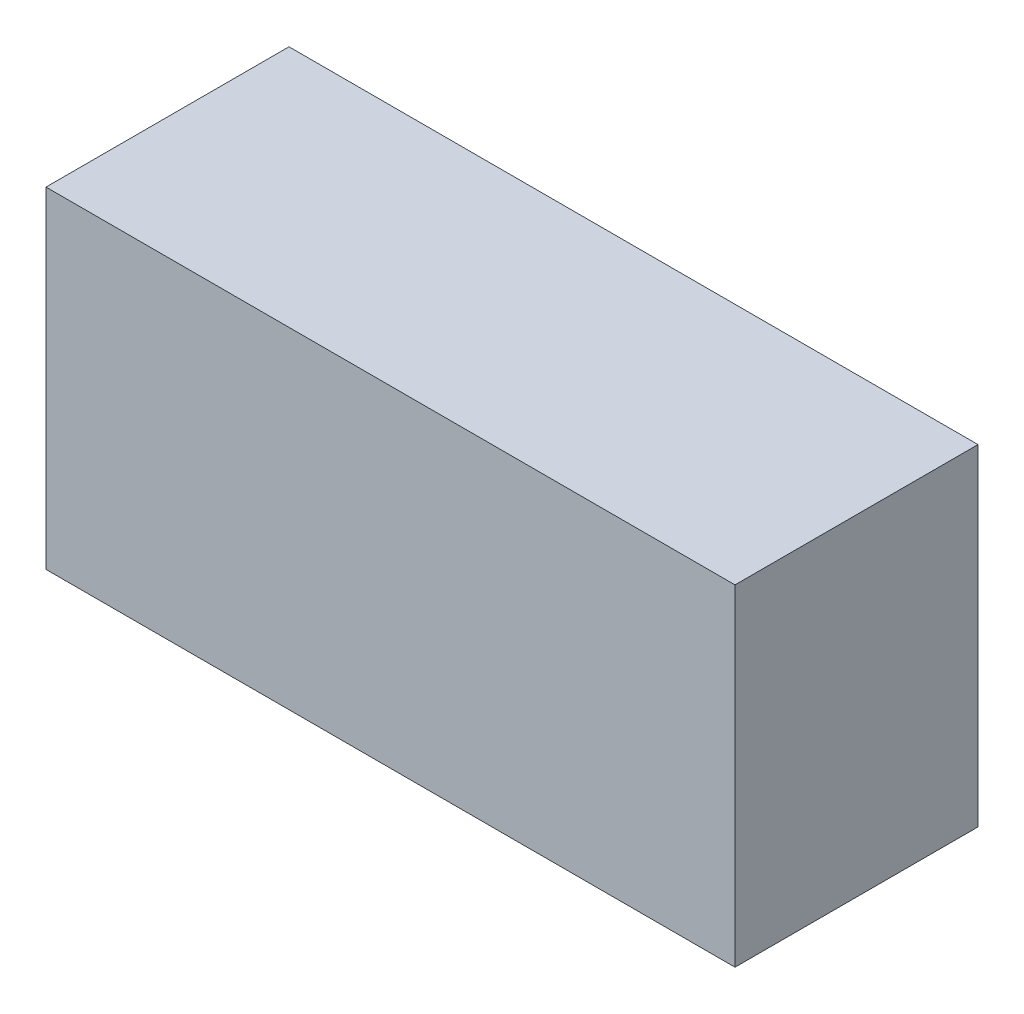
ISO-10303-21;
HEADER;
FILE_DESCRIPTION(('STEP AP214'),'2;1');
FILE_NAME('part.step','',(''),(''),'','','');
FILE_SCHEMA(('AUTOMOTIVE_DESIGN { 1 0 10303 214 1 1 1 1 }'));
ENDSEC;
DATA;
#1=APPLICATION_CONTEXT('core data for automotive mechanical design processes');
#2=APPLICATION_PROTOCOL_DEFINITION('international standard','automotive_design',2000,#1);
#3=PRODUCT_CONTEXT('',#1,'mechanical');
#4=PRODUCT('Part','Part','',(#3));
#5=PRODUCT_RELATED_PRODUCT_CATEGORY('part','',(#4));
#6=PRODUCT_DEFINITION_FORMATION('','',#4);
#7=PRODUCT_DEFINITION_CONTEXT('part definition',#1,'design');
#8=PRODUCT_DEFINITION('design','',#6,#7);
#9=PRODUCT_DEFINITION_SHAPE('','',#8);
#10=(LENGTH_UNIT() NAMED_UNIT(*) SI_UNIT(.MILLI.,.METRE.));
#11=(NAMED_UNIT(*) PLANE_ANGLE_UNIT() SI_UNIT($,.RADIAN.));
#12=(NAMED_UNIT(*) SI_UNIT($,.STERADIAN.) SOLID_ANGLE_UNIT());
#13=UNCERTAINTY_MEASURE_WITH_UNIT(LENGTH_MEASURE(1.E-05),#10,'distance_accuracy_value','');
#14=(GEOMETRIC_REPRESENTATION_CONTEXT(3) GLOBAL_UNCERTAINTY_ASSIGNED_CONTEXT((#13)) GLOBAL_UNIT_ASSIGNED_CONTEXT((#10,
#11,#12)) REPRESENTATION_CONTEXT('',''));
#15=CARTESIAN_POINT('',(0.,0.,0.));
#16=DIRECTION('',(0.,0.,1.));
#17=DIRECTION('',(1.,0.,0.));
#18=AXIS2_PLACEMENT_3D('',#15,#16,#17);
#19=CARTESIAN_POINT('',(1.55949142,0.74949304,1.10000034));
#20=DIRECTION('',(0.,0.,1.));
#21=DIRECTION('',(1.,0.,0.));
#22=AXIS2_PLACEMENT_3D('',#19,#20,#21);
#23=PLANE('',#22);
#24=DIRECTION('',(1.,0.,0.));
#25=VECTOR('',#24,1.);
#26=CARTESIAN_POINT('',(-1.55949142,0.74949304,1.10000034));
#27=LINE('',#26,#25);
#28=CARTESIAN_POINT('',(-1.55949142,0.74949304,1.10000034));
#29=VERTEX_POINT('',#28);
#30=CARTESIAN_POINT('',(1.55949142,0.74949304,1.10000034));
#31=VERTEX_POINT('',#30);
#32=EDGE_CURVE('E25',#29,#31,#27,.T.);
#33=ORIENTED_EDGE('',*,*,#32,.F.);
#34=DIRECTION('',(0.,1.,0.));
#35=VECTOR('',#34,1.);
#36=CARTESIAN_POINT('',(-1.55949142,-0.74949304,1.10000034));
#37=LINE('',#36,#35);
#38=CARTESIAN_POINT('',(-1.55949142,-0.74949304,1.10000034));
#39=VERTEX_POINT('',#38);
#40=EDGE_CURVE('E110',#39,#29,#37,.T.);
#41=ORIENTED_EDGE('',*,*,#40,.F.);
#42=DIRECTION('',(-1.,0.,0.));
#43=VECTOR('',#42,1.);
#44=CARTESIAN_POINT('',(1.55949142,-0.74949304,1.10000034));
#45=LINE('',#44,#43);
#46=CARTESIAN_POINT('',(1.55949142,-0.74949304,1.10000034));
#47=VERTEX_POINT('',#46);
#48=EDGE_CURVE('E83',#47,#39,#45,.T.);
#49=ORIENTED_EDGE('',*,*,#48,.F.);
#50=DIRECTION('',(0.,-1.,0.));
#51=VECTOR('',#50,1.);
#52=CARTESIAN_POINT('',(1.55949142,0.74949304,1.10000034));
#53=LINE('',#52,#51);
#54=EDGE_CURVE('E87',#31,#47,#53,.T.);
#55=ORIENTED_EDGE('',*,*,#54,.F.);
#56=EDGE_LOOP('',(#33,#41,#49,#55));
#57=FACE_BOUND('',#56,.T.);
#58=ADVANCED_FACE('F17',(#57),#23,.T.);
#59=CARTESIAN_POINT('',(1.55949142,0.74949304,0.));
#60=DIRECTION('',(0.,0.,1.));
#61=DIRECTION('',(1.,0.,0.));
#62=AXIS2_PLACEMENT_3D('',#59,#60,#61);
#63=PLANE('',#62);
#64=DIRECTION('',(0.,-1.,0.));
#65=VECTOR('',#64,1.);
#66=CARTESIAN_POINT('',(1.55949142,0.74949304,0.));
#67=LINE('',#66,#65);
#68=CARTESIAN_POINT('',(1.55949142,0.74949304,0.));
#69=VERTEX_POINT('',#68);
#70=CARTESIAN_POINT('',(1.55949142,-0.74949304,0.));
#71=VERTEX_POINT('',#70);
#72=EDGE_CURVE('E71',#69,#71,#67,.T.);
#73=ORIENTED_EDGE('',*,*,#72,.T.);
#74=DIRECTION('',(-1.,0.,0.));
#75=VECTOR('',#74,1.);
#76=CARTESIAN_POINT('',(1.55949142,-0.74949304,0.));
#77=LINE('',#76,#75);
#78=CARTESIAN_POINT('',(-1.55949142,-0.74949304,0.));
#79=VERTEX_POINT('',#78);
#80=EDGE_CURVE('E98',#71,#79,#77,.T.);
#81=ORIENTED_EDGE('',*,*,#80,.T.);
#82=DIRECTION('',(0.,1.,0.));
#83=VECTOR('',#82,1.);
#84=CARTESIAN_POINT('',(-1.55949142,-0.74949304,0.));
#85=LINE('',#84,#83);
#86=CARTESIAN_POINT('',(-1.55949142,0.74949304,0.));
#87=VERTEX_POINT('',#86);
#88=EDGE_CURVE('E73',#79,#87,#85,.T.);
#89=ORIENTED_EDGE('',*,*,#88,.T.);
#90=DIRECTION('',(1.,0.,0.));
#91=VECTOR('',#90,1.);
#92=CARTESIAN_POINT('',(-1.55949142,0.74949304,0.));
#93=LINE('',#92,#91);
#94=EDGE_CURVE('E11',#87,#69,#93,.T.);
#95=ORIENTED_EDGE('',*,*,#94,.T.);
#96=EDGE_LOOP('',(#73,#81,#89,#95));
#97=FACE_BOUND('',#96,.T.);
#98=ADVANCED_FACE('F69',(#97),#63,.F.);
#99=CARTESIAN_POINT('',(-1.55949142,0.74949304,0.));
#100=DIRECTION('',(0.,1.,0.));
#101=DIRECTION('',(1.,0.,0.));
#102=AXIS2_PLACEMENT_3D('',#99,#100,#101);
#103=PLANE('',#102);
#104=DIRECTION('',(0.,0.,1.));
#105=VECTOR('',#104,1.);
#106=CARTESIAN_POINT('',(-1.55949142,0.74949304,0.));
#107=LINE('',#106,#105);
#108=EDGE_CURVE('E107',#87,#29,#107,.T.);
#109=ORIENTED_EDGE('',*,*,#108,.T.);
#110=ORIENTED_EDGE('',*,*,#32,.T.);
#111=DIRECTION('',(0.,0.,1.));
#112=VECTOR('',#111,1.);
#113=CARTESIAN_POINT('',(1.55949142,0.74949304,0.));
#114=LINE('',#113,#112);
#115=EDGE_CURVE('E79',#69,#31,#114,.T.);
#116=ORIENTED_EDGE('',*,*,#115,.F.);
#117=ORIENTED_EDGE('',*,*,#94,.F.);
#118=EDGE_LOOP('',(#109,#110,#116,#117));
#119=FACE_BOUND('',#118,.T.);
#120=ADVANCED_FACE('F85',(#119),#103,.T.);
#121=CARTESIAN_POINT('',(-1.55949142,-0.74949304,0.));
#122=DIRECTION('',(-1.,0.,0.));
#123=DIRECTION('',(0.,0.,1.));
#124=AXIS2_PLACEMENT_3D('',#121,#122,#123);
#125=PLANE('',#124);
#126=DIRECTION('',(0.,0.,1.));
#127=VECTOR('',#126,1.);
#128=CARTESIAN_POINT('',(-1.55949142,-0.74949304,0.));
#129=LINE('',#128,#127);
#130=EDGE_CURVE('E95',#79,#39,#129,.T.);
#131=ORIENTED_EDGE('',*,*,#130,.T.);
#132=ORIENTED_EDGE('',*,*,#40,.T.);
#133=ORIENTED_EDGE('',*,*,#108,.F.);
#134=ORIENTED_EDGE('',*,*,#88,.F.);
#135=EDGE_LOOP('',(#131,#132,#133,#134));
#136=FACE_BOUND('',#135,.T.);
#137=ADVANCED_FACE('F170',(#136),#125,.T.);
#138=CARTESIAN_POINT('',(1.55949142,-0.74949304,0.));
#139=DIRECTION('',(0.,-1.,0.));
#140=DIRECTION('',(0.,0.,-1.));
#141=AXIS2_PLACEMENT_3D('',#138,#139,#140);
#142=PLANE('',#141);
#143=DIRECTION('',(0.,0.,1.));
#144=VECTOR('',#143,1.);
#145=CARTESIAN_POINT('',(1.55949142,-0.74949304,0.));
#146=LINE('',#145,#144);
#147=EDGE_CURVE('E81',#71,#47,#146,.T.);
#148=ORIENTED_EDGE('',*,*,#147,.T.);
#149=ORIENTED_EDGE('',*,*,#48,.T.);
#150=ORIENTED_EDGE('',*,*,#130,.F.);
#151=ORIENTED_EDGE('',*,*,#80,.F.);
#152=EDGE_LOOP('',(#148,#149,#150,#151));
#153=FACE_BOUND('',#152,.T.);
#154=ADVANCED_FACE('F159',(#153),#142,.T.);
#155=CARTESIAN_POINT('',(1.55949142,0.74949304,0.));
#156=DIRECTION('',(1.,0.,0.));
#157=DIRECTION('',(0.,1.,0.));
#158=AXIS2_PLACEMENT_3D('',#155,#156,#157);
#159=PLANE('',#158);
#160=ORIENTED_EDGE('',*,*,#115,.T.);
#161=ORIENTED_EDGE('',*,*,#54,.T.);
#162=ORIENTED_EDGE('',*,*,#147,.F.);
#163=ORIENTED_EDGE('',*,*,#72,.F.);
#164=EDGE_LOOP('',(#160,#161,#162,#163));
#165=FACE_BOUND('',#164,.T.);
#166=ADVANCED_FACE('F77',(#165),#159,.T.);
#167=CLOSED_SHELL('',(#58,#98,#120,#137,#154,#166));
#168=MANIFOLD_SOLID_BREP('B1',#167);
#169=ADVANCED_BREP_SHAPE_REPRESENTATION('',(#18,#168),#14);
#170=SHAPE_DEFINITION_REPRESENTATION(#9,#169);
ENDSEC;
END-ISO-10303-21;
